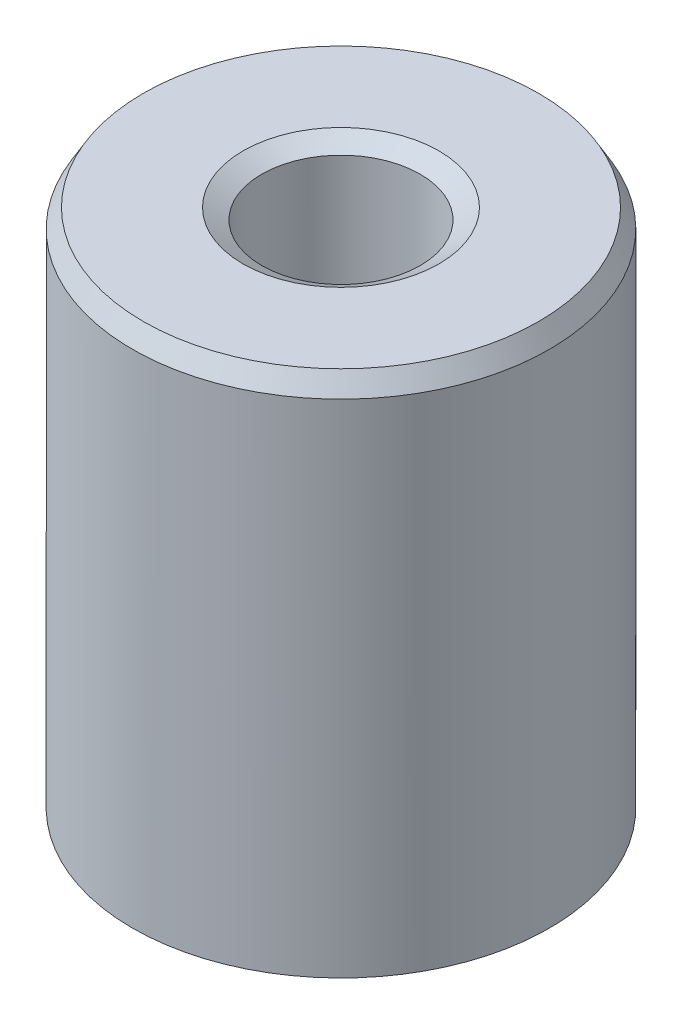
ISO-10303-21;
HEADER;
FILE_DESCRIPTION(('STEP AP214'),'2;1');
FILE_NAME('part.step','',(''),(''),'','','');
FILE_SCHEMA(('AUTOMOTIVE_DESIGN { 1 0 10303 214 1 1 1 1 }'));
ENDSEC;
DATA;
#1=APPLICATION_CONTEXT('core data for automotive mechanical design processes');
#2=APPLICATION_PROTOCOL_DEFINITION('international standard','automotive_design',2000,#1);
#3=PRODUCT_CONTEXT('',#1,'mechanical');
#4=PRODUCT('Part','Part','',(#3));
#5=PRODUCT_RELATED_PRODUCT_CATEGORY('part','',(#4));
#6=PRODUCT_DEFINITION_FORMATION('','',#4);
#7=PRODUCT_DEFINITION_CONTEXT('part definition',#1,'design');
#8=PRODUCT_DEFINITION('design','',#6,#7);
#9=PRODUCT_DEFINITION_SHAPE('','',#8);
#10=(LENGTH_UNIT() NAMED_UNIT(*) SI_UNIT(.MILLI.,.METRE.));
#11=(NAMED_UNIT(*) PLANE_ANGLE_UNIT() SI_UNIT($,.RADIAN.));
#12=(NAMED_UNIT(*) SI_UNIT($,.STERADIAN.) SOLID_ANGLE_UNIT());
#13=UNCERTAINTY_MEASURE_WITH_UNIT(LENGTH_MEASURE(1.E-05),#10,'distance_accuracy_value','');
#14=(GEOMETRIC_REPRESENTATION_CONTEXT(3) GLOBAL_UNCERTAINTY_ASSIGNED_CONTEXT((#13)) GLOBAL_UNIT_ASSIGNED_CONTEXT((#10,
#11,#12)) REPRESENTATION_CONTEXT('',''));
#15=CARTESIAN_POINT('',(0.,0.,0.));
#16=DIRECTION('',(0.,0.,1.));
#17=DIRECTION('',(1.,0.,0.));
#18=AXIS2_PLACEMENT_3D('',#15,#16,#17);
#19=CARTESIAN_POINT('',(0.,38.1916685769268,0.));
#20=DIRECTION('',(0.,-1.,0.));
#21=DIRECTION('',(0.,0.,-1.));
#22=AXIS2_PLACEMENT_3D('',#19,#20,#21);
#23=CYLINDRICAL_SURFACE('',#22,15.);
#24=CARTESIAN_POINT('',(0.,0.777088316908363,0.));
#25=DIRECTION('',(0.,1.,0.));
#26=DIRECTION('',(0.,0.,1.));
#27=AXIS2_PLACEMENT_3D('',#24,#25,#26);
#28=CIRCLE('',#27,15.);
#29=CARTESIAN_POINT('',(0.,0.777088316908356,-15.));
#30=VERTEX_POINT('',#29);
#31=EDGE_CURVE('E10',#30,#30,#28,.T.);
#32=CARTESIAN_POINT('',(0.,36.8457121300734,0.));
#33=DIRECTION('',(0.,1.,0.));
#34=DIRECTION('',(0.,0.,1.));
#35=AXIS2_PLACEMENT_3D('',#32,#33,#34);
#36=CIRCLE('',#35,15.);
#37=CARTESIAN_POINT('',(0.,36.8457121300734,-15.));
#38=VERTEX_POINT('',#37);
#39=EDGE_CURVE('E50',#38,#38,#36,.F.);
#40=CARTESIAN_POINT('',(0.,0.777088316908356,-15.));
#41=CARTESIAN_POINT('',(0.,1.15280314829549,-15.));
#42=CARTESIAN_POINT('',(0.,1.52851797968263,-15.));
#43=CARTESIAN_POINT('',(0.,2.2799476424569,-15.));
#44=CARTESIAN_POINT('',(0.,2.65566247384403,-15.));
#45=CARTESIAN_POINT('',(0.,3.4070921366183,-15.));
#46=CARTESIAN_POINT('',(0.,3.78280696800544,-15.));
#47=CARTESIAN_POINT('',(0.,4.53423663077971,-15.));
#48=CARTESIAN_POINT('',(0.,4.90995146216685,-15.));
#49=CARTESIAN_POINT('',(0.,5.66138112494112,-15.));
#50=CARTESIAN_POINT('',(0.,6.03709595632825,-15.));
#51=CARTESIAN_POINT('',(0.,6.78852561910253,-15.));
#52=CARTESIAN_POINT('',(0.,7.16424045048966,-15.));
#53=CARTESIAN_POINT('',(0.,7.91567011326393,-15.));
#54=CARTESIAN_POINT('',(0.,8.29138494465106,-15.));
#55=CARTESIAN_POINT('',(0.,9.04281460742533,-15.));
#56=CARTESIAN_POINT('',(0.,9.41852943881247,-15.));
#57=CARTESIAN_POINT('',(0.,10.1699591015867,-15.));
#58=CARTESIAN_POINT('',(0.,10.5456739329739,-15.));
#59=CARTESIAN_POINT('',(0.,11.2971035957481,-15.));
#60=CARTESIAN_POINT('',(0.,11.6728184271353,-15.));
#61=CARTESIAN_POINT('',(0.,12.4242480899096,-15.));
#62=CARTESIAN_POINT('',(0.,12.7999629212967,-15.));
#63=CARTESIAN_POINT('',(0.,13.551392584071,-15.));
#64=CARTESIAN_POINT('',(0.,13.9271074154581,-15.));
#65=CARTESIAN_POINT('',(0.,14.6785370782324,-15.));
#66=CARTESIAN_POINT('',(0.,15.0542519096195,-15.));
#67=CARTESIAN_POINT('',(0.,15.8056815723938,-15.));
#68=CARTESIAN_POINT('',(0.,16.1813964037809,-15.));
#69=CARTESIAN_POINT('',(0.,16.9328260665552,-15.));
#70=CARTESIAN_POINT('',(0.,17.3085408979423,-15.));
#71=CARTESIAN_POINT('',(0.,18.0599705607166,-15.));
#72=CARTESIAN_POINT('',(0.,18.4356853921037,-15.));
#73=CARTESIAN_POINT('',(0.,19.187115054878,-15.));
#74=CARTESIAN_POINT('',(0.,19.5628298862651,-15.));
#75=CARTESIAN_POINT('',(0.,20.3142595490394,-15.));
#76=CARTESIAN_POINT('',(0.,20.6899743804265,-15.));
#77=CARTESIAN_POINT('',(0.,21.4414040432008,-15.));
#78=CARTESIAN_POINT('',(0.,21.8171188745879,-15.));
#79=CARTESIAN_POINT('',(0.,22.5685485373622,-15.));
#80=CARTESIAN_POINT('',(0.,22.9442633687493,-15.));
#81=CARTESIAN_POINT('',(0.,23.6956930315236,-15.));
#82=CARTESIAN_POINT('',(0.,24.0714078629108,-15.));
#83=CARTESIAN_POINT('',(0.,24.822837525685,-15.));
#84=CARTESIAN_POINT('',(0.,25.1985523570722,-15.));
#85=CARTESIAN_POINT('',(0.,25.9499820198464,-15.));
#86=CARTESIAN_POINT('',(0.,26.3256968512336,-15.));
#87=CARTESIAN_POINT('',(0.,27.0771265140078,-15.));
#88=CARTESIAN_POINT('',(0.,27.452841345395,-15.));
#89=CARTESIAN_POINT('',(0.,28.2042710081693,-15.));
#90=CARTESIAN_POINT('',(0.,28.5799858395564,-15.));
#91=CARTESIAN_POINT('',(0.,29.3314155023307,-15.));
#92=CARTESIAN_POINT('',(0.,29.7071303337178,-15.));
#93=CARTESIAN_POINT('',(0.,30.4585599964921,-15.));
#94=CARTESIAN_POINT('',(0.,30.8342748278792,-15.));
#95=CARTESIAN_POINT('',(0.,31.5857044906535,-15.));
#96=CARTESIAN_POINT('',(0.,31.9614193220406,-15.));
#97=CARTESIAN_POINT('',(0.,32.7128489848149,-15.));
#98=CARTESIAN_POINT('',(0.,33.088563816202,-15.));
#99=CARTESIAN_POINT('',(0.,33.8399934789763,-15.));
#100=CARTESIAN_POINT('',(0.,34.2157083103634,-15.));
#101=CARTESIAN_POINT('',(0.,34.9671379731377,-15.));
#102=CARTESIAN_POINT('',(0.,35.3428528045248,-15.));
#103=CARTESIAN_POINT('',(0.,36.0942824672991,-15.));
#104=CARTESIAN_POINT('',(0.,36.4699972986862,-15.));
#105=CARTESIAN_POINT('',(0.,36.8457121300734,-15.));
#106=B_SPLINE_CURVE_WITH_KNOTS('',3,(#40,#41,#42,#43,#44,#45,#46,#47,#48,#49,#50,#51,#52,#53,
#54,#55,#56,#57,#58,#59,#60,#61,#62,#63,#64,#65,#66,#67,#68,#69,#70,#71,#72,#73,#74,#75,#76,#77,
#78,#79,#80,#81,#82,#83,#84,#85,#86,#87,#88,#89,#90,#91,#92,#93,#94,#95,#96,#97,#98,#99,#100,
#101,#102,#103,#104,#105),.UNSPECIFIED.,.F.,.F.,(4,2,2,2,2,2,2,2,2,2,2,2,2,2,2,2,2,2,2,2,2,2,2,
2,2,2,2,2,2,2,2,2,4),(0.,1.12714449416141,2.25428898832281,3.38143348248422,4.50857797664563,
5.63572247080703,6.76286696496844,7.89001145912984,9.01715595329125,10.1443004474527,
11.2714449416141,12.3985894357755,13.5257339299369,14.6528784240983,15.7800229182597,
16.9071674124211,18.0343119065825,19.1614564007439,20.2886008949053,21.4157453890667,
22.5428898832281,23.6700343773895,24.7971788715509,25.9243233657123,27.0514678598738,
28.1786123540352,29.3057568481966,30.432901342358,31.5600458365194,32.6871903306808,
33.8143348248422,34.9414793190036,36.068623813165),.UNSPECIFIED.);
#107=EDGE_CURVE('BSEAM39',#30,#38,#106,.T.);
#108=ORIENTED_EDGE('',*,*,#31,.T.);
#109=ORIENTED_EDGE('',*,*,#39,.T.);
#110=ORIENTED_EDGE('',*,*,#107,.T.);
#111=ORIENTED_EDGE('',*,*,#107,.F.);
#112=EDGE_LOOP('',(#108,#110,#109,#111));
#113=FACE_BOUND('',#112,.T.);
#114=ADVANCED_FACE('F39',(#113),#23,.T.);
#115=CARTESIAN_POINT('',(0.,38.1916685769268,0.));
#116=DIRECTION('',(0.,1.,0.));
#117=DIRECTION('',(0.,0.,1.));
#118=AXIS2_PLACEMENT_3D('',#115,#116,#117);
#119=PLANE('',#118);
#120=CARTESIAN_POINT('',(0.,38.1916685769268,0.));
#121=DIRECTION('',(0.,1.,0.));
#122=DIRECTION('',(0.,0.,1.));
#123=AXIS2_PLACEMENT_3D('',#120,#121,#122);
#124=CIRCLE('',#123,7.04701732335984);
#125=CARTESIAN_POINT('',(0.,38.1916685769268,7.04701732335984));
#126=VERTEX_POINT('',#125);
#127=EDGE_CURVE('E58',#126,#126,#124,.F.);
#128=ORIENTED_EDGE('',*,*,#127,.T.);
#129=EDGE_LOOP('',(#128));
#130=FACE_BOUND('',#129,.T.);
#131=CARTESIAN_POINT('',(0.,38.1916685769268,0.));
#132=DIRECTION('',(0.,1.,0.));
#133=DIRECTION('',(0.,0.,1.));
#134=AXIS2_PLACEMENT_3D('',#131,#132,#133);
#135=CIRCLE('',#134,14.2229116830917);
#136=CARTESIAN_POINT('',(0.,38.1916685769268,14.2229116830917));
#137=VERTEX_POINT('',#136);
#138=EDGE_CURVE('E61',#137,#137,#135,.T.);
#139=ORIENTED_EDGE('',*,*,#138,.T.);
#140=EDGE_LOOP('',(#139));
#141=FACE_BOUND('',#140,.T.);
#142=ADVANCED_FACE('F88',(#130,#141),#119,.T.);
#143=CARTESIAN_POINT('',(0.,0.,0.));
#144=DIRECTION('',(0.,1.,0.));
#145=DIRECTION('',(0.,0.,1.));
#146=AXIS2_PLACEMENT_3D('',#143,#144,#145);
#147=PLANE('',#146);
#148=CARTESIAN_POINT('',(0.,0.,0.));
#149=DIRECTION('',(0.,1.,0.));
#150=DIRECTION('',(0.,0.,1.));
#151=AXIS2_PLACEMENT_3D('',#148,#149,#150);
#152=CIRCLE('',#151,6.47814919341472);
#153=CARTESIAN_POINT('',(0.,0.,-6.47814919341472));
#154=VERTEX_POINT('',#153);
#155=EDGE_CURVE('E51',#154,#154,#152,.T.);
#156=ORIENTED_EDGE('',*,*,#155,.T.);
#157=EDGE_LOOP('',(#156));
#158=FACE_BOUND('',#157,.T.);
#159=CARTESIAN_POINT('',(0.,0.,0.));
#160=DIRECTION('',(0.,1.,0.));
#161=DIRECTION('',(0.,0.,1.));
#162=AXIS2_PLACEMENT_3D('',#159,#160,#161);
#163=CIRCLE('',#162,13.6540435531465);
#164=CARTESIAN_POINT('',(0.,0.,13.6540435531465));
#165=VERTEX_POINT('',#164);
#166=EDGE_CURVE('E54',#165,#165,#163,.F.);
#167=ORIENTED_EDGE('',*,*,#166,.T.);
#168=EDGE_LOOP('',(#167));
#169=FACE_BOUND('',#168,.T.);
#170=ADVANCED_FACE('F83',(#158,#169),#147,.F.);
#171=CARTESIAN_POINT('',(0.,38.1916685769268,0.));
#172=DIRECTION('',(0.,-1.,0.));
#173=DIRECTION('',(0.,0.,-1.));
#174=AXIS2_PLACEMENT_3D('',#171,#172,#173);
#175=CYLINDRICAL_SURFACE('',#174,5.70106087650638);
#176=CARTESIAN_POINT('',(0.,37.4145802600184,0.));
#177=DIRECTION('',(0.,1.,0.));
#178=DIRECTION('',(0.,0.,1.));
#179=AXIS2_PLACEMENT_3D('',#176,#177,#178);
#180=CIRCLE('',#179,5.70106087650638);
#181=CARTESIAN_POINT('',(0.,37.4145802600184,-5.70106087650638));
#182=VERTEX_POINT('',#181);
#183=EDGE_CURVE('E67',#182,#182,#180,.T.);
#184=CARTESIAN_POINT('',(0.,1.34595644685344,0.));
#185=DIRECTION('',(0.,1.,0.));
#186=DIRECTION('',(0.,0.,1.));
#187=AXIS2_PLACEMENT_3D('',#184,#185,#186);
#188=CIRCLE('',#187,5.70106087650638);
#189=CARTESIAN_POINT('',(0.,1.34595644685344,-5.70106087650638));
#190=VERTEX_POINT('',#189);
#191=EDGE_CURVE('E69',#190,#190,#188,.F.);
#192=CARTESIAN_POINT('',(0.,37.4145802600184,-5.70106087650638));
#193=CARTESIAN_POINT('',(0.,37.0388654286313,-5.70106087650638));
#194=CARTESIAN_POINT('',(0.,36.6631505972441,-5.70106087650638));
#195=CARTESIAN_POINT('',(0.,35.9117209344699,-5.70106087650638));
#196=CARTESIAN_POINT('',(0.,35.5360061030827,-5.70106087650638));
#197=CARTESIAN_POINT('',(0.,34.7845764403085,-5.70106087650638));
#198=CARTESIAN_POINT('',(0.,34.4088616089213,-5.70106087650638));
#199=CARTESIAN_POINT('',(0.,33.6574319461471,-5.70106087650638));
#200=CARTESIAN_POINT('',(0.,33.2817171147599,-5.70106087650638));
#201=CARTESIAN_POINT('',(0.,32.5302874519857,-5.70106087650638));
#202=CARTESIAN_POINT('',(0.,32.1545726205985,-5.70106087650638));
#203=CARTESIAN_POINT('',(0.,31.4031429578242,-5.70106087650638));
#204=CARTESIAN_POINT('',(0.,31.0274281264371,-5.70106087650638));
#205=CARTESIAN_POINT('',(0.,30.2759984636628,-5.70106087650638));
#206=CARTESIAN_POINT('',(0.,29.9002836322757,-5.70106087650638));
#207=CARTESIAN_POINT('',(0.,29.1488539695014,-5.70106087650638));
#208=CARTESIAN_POINT('',(0.,28.7731391381143,-5.70106087650638));
#209=CARTESIAN_POINT('',(0.,28.02170947534,-5.70106087650638));
#210=CARTESIAN_POINT('',(0.,27.6459946439529,-5.70106087650638));
#211=CARTESIAN_POINT('',(0.,26.8945649811786,-5.70106087650638));
#212=CARTESIAN_POINT('',(0.,26.5188501497915,-5.70106087650638));
#213=CARTESIAN_POINT('',(0.,25.7674204870172,-5.70106087650638));
#214=CARTESIAN_POINT('',(0.,25.3917056556301,-5.70106087650638));
#215=CARTESIAN_POINT('',(0.,24.6402759928558,-5.70106087650638));
#216=CARTESIAN_POINT('',(0.,24.2645611614687,-5.70106087650638));
#217=CARTESIAN_POINT('',(0.,23.5131314986944,-5.70106087650638));
#218=CARTESIAN_POINT('',(0.,23.1374166673073,-5.70106087650638));
#219=CARTESIAN_POINT('',(0.,22.385987004533,-5.70106087650638));
#220=CARTESIAN_POINT('',(0.,22.0102721731459,-5.70106087650638));
#221=CARTESIAN_POINT('',(0.,21.2588425103716,-5.70106087650638));
#222=CARTESIAN_POINT('',(0.,20.8831276789845,-5.70106087650638));
#223=CARTESIAN_POINT('',(0.,20.1316980162102,-5.70106087650638));
#224=CARTESIAN_POINT('',(0.,19.7559831848231,-5.70106087650638));
#225=CARTESIAN_POINT('',(0.,19.0045535220488,-5.70106087650638));
#226=CARTESIAN_POINT('',(0.,18.6288386906617,-5.70106087650638));
#227=CARTESIAN_POINT('',(0.,17.8774090278874,-5.70106087650638));
#228=CARTESIAN_POINT('',(0.,17.5016941965002,-5.70106087650638));
#229=CARTESIAN_POINT('',(0.,16.750264533726,-5.70106087650638));
#230=CARTESIAN_POINT('',(0.,16.3745497023388,-5.70106087650638));
#231=CARTESIAN_POINT('',(0.,15.6231200395646,-5.70106087650638));
#232=CARTESIAN_POINT('',(0.,15.2474052081774,-5.70106087650638));
#233=CARTESIAN_POINT('',(0.,14.4959755454032,-5.70106087650638));
#234=CARTESIAN_POINT('',(0.,14.120260714016,-5.70106087650638));
#235=CARTESIAN_POINT('',(0.,13.3688310512418,-5.70106087650638));
#236=CARTESIAN_POINT('',(0.,12.9931162198546,-5.70106087650638));
#237=CARTESIAN_POINT('',(0.,12.2416865570804,-5.70106087650638));
#238=CARTESIAN_POINT('',(0.,11.8659717256932,-5.70106087650638));
#239=CARTESIAN_POINT('',(0.,11.114542062919,-5.70106087650638));
#240=CARTESIAN_POINT('',(0.,10.7388272315318,-5.70106087650638));
#241=CARTESIAN_POINT('',(0.,9.98739756875755,-5.70106087650638));
#242=CARTESIAN_POINT('',(0.,9.61168273737041,-5.70106087650638));
#243=CARTESIAN_POINT('',(0.,8.86025307459614,-5.70106087650638));
#244=CARTESIAN_POINT('',(0.,8.48453824320901,-5.70106087650638));
#245=CARTESIAN_POINT('',(0.,7.73310858043473,-5.70106087650638));
#246=CARTESIAN_POINT('',(0.,7.3573937490476,-5.70106087650638));
#247=CARTESIAN_POINT('',(0.,6.60596408627333,-5.70106087650638));
#248=CARTESIAN_POINT('',(0.,6.2302492548862,-5.70106087650638));
#249=CARTESIAN_POINT('',(0.,5.47881959211193,-5.70106087650638));
#250=CARTESIAN_POINT('',(0.,5.10310476072479,-5.70106087650638));
#251=CARTESIAN_POINT('',(0.,4.35167509795052,-5.70106087650638));
#252=CARTESIAN_POINT('',(0.,3.97596026656339,-5.70106087650638));
#253=CARTESIAN_POINT('',(0.,3.22453060378911,-5.70106087650638));
#254=CARTESIAN_POINT('',(0.,2.84881577240198,-5.70106087650638));
#255=CARTESIAN_POINT('',(0.,2.09738610962771,-5.70106087650638));
#256=CARTESIAN_POINT('',(0.,1.72167127824057,-5.70106087650638));
#257=CARTESIAN_POINT('',(0.,1.34595644685344,-5.70106087650638));
#258=B_SPLINE_CURVE_WITH_KNOTS('',3,(#192,#193,#194,#195,#196,#197,#198,#199,#200,#201,#202,
#203,#204,#205,#206,#207,#208,#209,#210,#211,#212,#213,#214,#215,#216,#217,#218,#219,#220,#221,
#222,#223,#224,#225,#226,#227,#228,#229,#230,#231,#232,#233,#234,#235,#236,#237,#238,#239,#240,
#241,#242,#243,#244,#245,#246,#247,#248,#249,#250,#251,#252,#253,#254,#255,#256,#257),
.UNSPECIFIED.,.F.,.F.,(4,2,2,2,2,2,2,2,2,2,2,2,2,2,2,2,2,2,2,2,2,2,2,2,2,2,2,2,2,2,2,2,4),(0.,
1.1271444941614,2.25428898832281,3.38143348248422,4.50857797664562,5.63572247080702,
6.76286696496843,7.89001145912983,9.01715595329124,10.1443004474526,11.271444941614,
12.3985894357755,13.5257339299369,14.6528784240983,15.7800229182597,16.9071674124211,
18.0343119065825,19.1614564007439,20.2886008949053,21.4157453890667,22.5428898832281,
23.6700343773895,24.7971788715509,25.9243233657123,27.0514678598737,28.1786123540351,
29.3057568481965,30.4329013423579,31.5600458365193,32.6871903306807,33.8143348248422,
34.9414793190036,36.068623813165),.UNSPECIFIED.);
#259=EDGE_CURVE('BSEAM71',#182,#190,#258,.T.);
#260=ORIENTED_EDGE('',*,*,#183,.T.);
#261=ORIENTED_EDGE('',*,*,#191,.T.);
#262=ORIENTED_EDGE('',*,*,#259,.T.);
#263=ORIENTED_EDGE('',*,*,#259,.F.);
#264=EDGE_LOOP('',(#260,#262,#261,#263));
#265=FACE_BOUND('',#264,.T.);
#266=ADVANCED_FACE('F71',(#265),#175,.F.);
#267=CARTESIAN_POINT('',(0.,37.4145802600184,0.));
#268=DIRECTION('',(0.,1.,0.));
#269=DIRECTION('',(0.,0.,1.));
#270=AXIS2_PLACEMENT_3D('',#267,#268,#269);
#271=CONICAL_SURFACE('',#270,5.70106087650638,1.0471975511966);
#272=ORIENTED_EDGE('',*,*,#127,.F.);
#273=EDGE_LOOP('',(#272));
#274=FACE_BOUND('',#273,.T.);
#275=ORIENTED_EDGE('',*,*,#183,.F.);
#276=EDGE_LOOP('',(#275));
#277=FACE_BOUND('',#276,.T.);
#278=ADVANCED_FACE('F77',(#274,#277),#271,.F.);
#279=CARTESIAN_POINT('',(0.,0.,0.));
#280=DIRECTION('',(0.,-1.,0.));
#281=DIRECTION('',(0.,0.,-1.));
#282=AXIS2_PLACEMENT_3D('',#279,#280,#281);
#283=CONICAL_SURFACE('',#282,6.47814919341472,0.523598775598296);
#284=CARTESIAN_POINT('',(0.,1.34595644685344,-5.70106087650638));
#285=CARTESIAN_POINT('',(0.,1.33193606719872,-5.70915554647417));
#286=CARTESIAN_POINT('',(0.,1.31791568754399,-5.71725021644197));
#287=CARTESIAN_POINT('',(0.,1.28987492823455,-5.73343955637756));
#288=CARTESIAN_POINT('',(0.,1.27585454857982,-5.74153422634535));
#289=CARTESIAN_POINT('',(0.,1.24781378927038,-5.75772356628094));
#290=CARTESIAN_POINT('',(0.,1.23379340961565,-5.76581823624874));
#291=CARTESIAN_POINT('',(0.,1.20575265030621,-5.78200757618433));
#292=CARTESIAN_POINT('',(0.,1.19173227065148,-5.79010224615212));
#293=CARTESIAN_POINT('',(0.,1.16369151134204,-5.80629158608771));
#294=CARTESIAN_POINT('',(0.,1.14967113168731,-5.81438625605551));
#295=CARTESIAN_POINT('',(0.,1.12163037237787,-5.8305755959911));
#296=CARTESIAN_POINT('',(0.,1.10760999272314,-5.8386702659589));
#297=CARTESIAN_POINT('',(0.,1.0795692334137,-5.85485960589449));
#298=CARTESIAN_POINT('',(0.,1.06554885375897,-5.86295427586228));
#299=CARTESIAN_POINT('',(0.,1.03750809444953,-5.87914361579787));
#300=CARTESIAN_POINT('',(0.,1.0234877147948,-5.88723828576567));
#301=CARTESIAN_POINT('',(0.,0.995446955485355,-5.90342762570126));
#302=CARTESIAN_POINT('',(0.,0.981426575830632,-5.91152229566905));
#303=CARTESIAN_POINT('',(0.,0.953385816521185,-5.92771163560464));
#304=CARTESIAN_POINT('',(0.,0.939365436866462,-5.93580630557244));
#305=CARTESIAN_POINT('',(0.,0.911324677557016,-5.95199564550803));
#306=CARTESIAN_POINT('',(0.,0.897304297902292,-5.96009031547582));
#307=CARTESIAN_POINT('',(0.,0.869263538592846,-5.97627965541141));
#308=CARTESIAN_POINT('',(0.,0.855243158938122,-5.98437432537921));
#309=CARTESIAN_POINT('',(0.,0.827202399628676,-6.0005636653148));
#310=CARTESIAN_POINT('',(0.,0.813182019973952,-6.00865833528259));
#311=CARTESIAN_POINT('',(0.,0.785141260664506,-6.02484767521818));
#312=CARTESIAN_POINT('',(0.,0.771120881009782,-6.03294234518598));
#313=CARTESIAN_POINT('',(0.,0.743080121700336,-6.04913168512157));
#314=CARTESIAN_POINT('',(0.,0.729059742045612,-6.05722635508937));
#315=CARTESIAN_POINT('',(0.,0.701018982736166,-6.07341569502496));
#316=CARTESIAN_POINT('',(0.,0.686998603081442,-6.08151036499275));
#317=CARTESIAN_POINT('',(0.,0.658957843771996,-6.09769970492834));
#318=CARTESIAN_POINT('',(0.,0.644937464117273,-6.10579437489614));
#319=CARTESIAN_POINT('',(0.,0.616896704807826,-6.12198371483173));
#320=CARTESIAN_POINT('',(0.,0.602876325153103,-6.13007838479952));
#321=CARTESIAN_POINT('',(0.,0.574835565843656,-6.14626772473511));
#322=CARTESIAN_POINT('',(0.,0.560815186188933,-6.15436239470291));
#323=CARTESIAN_POINT('',(0.,0.532774426879486,-6.1705517346385));
#324=CARTESIAN_POINT('',(0.,0.518754047224763,-6.17864640460629));
#325=CARTESIAN_POINT('',(0.,0.490713287915316,-6.19483574454188));
#326=CARTESIAN_POINT('',(0.,0.476692908260593,-6.20293041450968));
#327=CARTESIAN_POINT('',(0.,0.448652148951146,-6.21911975444527));
#328=CARTESIAN_POINT('',(0.,0.434631769296423,-6.22721442441307));
#329=CARTESIAN_POINT('',(0.,0.406591009986976,-6.24340376434866));
#330=CARTESIAN_POINT('',(0.,0.392570630332253,-6.25149843431645));
#331=CARTESIAN_POINT('',(0.,0.364529871022806,-6.26768777425204));
#332=CARTESIAN_POINT('',(0.,0.350509491368083,-6.27578244421984));
#333=CARTESIAN_POINT('',(0.,0.322468732058636,-6.29197178415543));
#334=CARTESIAN_POINT('',(0.,0.308448352403913,-6.30006645412322));
#335=CARTESIAN_POINT('',(0.,0.280407593094466,-6.31625579405881));
#336=CARTESIAN_POINT('',(0.,0.266387213439743,-6.32435046402661));
#337=CARTESIAN_POINT('',(0.,0.238346454130296,-6.3405398039622));
#338=CARTESIAN_POINT('',(0.,0.224326074475573,-6.34863447392999));
#339=CARTESIAN_POINT('',(0.,0.196285315166126,-6.36482381386558));
#340=CARTESIAN_POINT('',(0.,0.182264935511403,-6.37291848383338));
#341=CARTESIAN_POINT('',(0.,0.154224176201956,-6.38910782376897));
#342=CARTESIAN_POINT('',(0.,0.140203796547233,-6.39720249373676));
#343=CARTESIAN_POINT('',(0.,0.112163037237787,-6.41339183367235));
#344=CARTESIAN_POINT('',(0.,0.0981426575830632,-6.42148650364015));
#345=CARTESIAN_POINT('',(0.,0.0701018982736166,-6.43767584357574));
#346=CARTESIAN_POINT('',(0.,0.0560815186188933,-6.44577051354354));
#347=CARTESIAN_POINT('',(0.,0.0280407593094466,-6.46195985347913));
#348=CARTESIAN_POINT('',(0.,0.0140203796547233,-6.47005452344692));
#349=CARTESIAN_POINT('',(0.,0.,-6.47814919341472));
#350=B_SPLINE_CURVE_WITH_KNOTS('',3,(#284,#285,#286,#287,#288,#289,#290,#291,#292,#293,#294,
#295,#296,#297,#298,#299,#300,#301,#302,#303,#304,#305,#306,#307,#308,#309,#310,#311,#312,#313,
#314,#315,#316,#317,#318,#319,#320,#321,#322,#323,#324,#325,#326,#327,#328,#329,#330,#331,#332,
#333,#334,#335,#336,#337,#338,#339,#340,#341,#342,#343,#344,#345,#346,#347,#348,#349),
.UNSPECIFIED.,.F.,.F.,(4,2,2,2,2,2,2,2,2,2,2,2,2,2,2,2,2,2,2,2,2,2,2,2,2,2,2,2,2,2,2,2,4),(0.,
0.0485680198067715,0.097136039613543,0.145704059420315,0.194272079227086,0.242840099033858,
0.291408118840629,0.339976138647401,0.388544158454172,0.437112178260944,0.485680198067715,
0.534248217874487,0.582816237681258,0.631384257488029,0.679952277294801,0.728520297101572,
0.777088316908344,0.825656336715115,0.874224356521886,0.922792376328658,0.971360396135429,
1.0199284159422,1.06849643574897,1.11706445555574,1.16563247536252,1.21420049516929,
1.26276851497606,1.31133653478283,1.3599045545896,1.40847257439637,1.45704059420314,
1.50560861400992,1.55417663381669),.UNSPECIFIED.);
#351=EDGE_CURVE('BSEAM73',#190,#154,#350,.T.);
#352=ORIENTED_EDGE('',*,*,#191,.F.);
#353=ORIENTED_EDGE('',*,*,#155,.F.);
#354=ORIENTED_EDGE('',*,*,#351,.T.);
#355=ORIENTED_EDGE('',*,*,#351,.F.);
#356=EDGE_LOOP('',(#352,#354,#353,#355));
#357=FACE_BOUND('',#356,.T.);
#358=ADVANCED_FACE('F73',(#357),#283,.F.);
#359=CARTESIAN_POINT('',(0.,0.777088316908363,0.));
#360=DIRECTION('',(0.,1.,0.));
#361=DIRECTION('',(0.,0.,1.));
#362=AXIS2_PLACEMENT_3D('',#359,#360,#361);
#363=CONICAL_SURFACE('',#362,15.,1.0471975511966);
#364=ORIENTED_EDGE('',*,*,#166,.F.);
#365=EDGE_LOOP('',(#364));
#366=FACE_BOUND('',#365,.T.);
#367=ORIENTED_EDGE('',*,*,#31,.F.);
#368=EDGE_LOOP('',(#367));
#369=FACE_BOUND('',#368,.T.);
#370=ADVANCED_FACE('F76',(#366,#369),#363,.T.);
#371=CARTESIAN_POINT('',(0.,38.1916685769268,0.));
#372=DIRECTION('',(0.,-1.,0.));
#373=DIRECTION('',(0.,0.,-1.));
#374=AXIS2_PLACEMENT_3D('',#371,#372,#373);
#375=CONICAL_SURFACE('',#374,14.2229116830917,0.523598775598291);
#376=ORIENTED_EDGE('',*,*,#39,.F.);
#377=EDGE_LOOP('',(#376));
#378=FACE_BOUND('',#377,.T.);
#379=ORIENTED_EDGE('',*,*,#138,.F.);
#380=EDGE_LOOP('',(#379));
#381=FACE_BOUND('',#380,.T.);
#382=ADVANCED_FACE('F45',(#378,#381),#375,.T.);
#383=CLOSED_SHELL('',(#114,#142,#170,#266,#278,#358,#370,#382));
#384=MANIFOLD_SOLID_BREP('B2',#383);
#385=ADVANCED_BREP_SHAPE_REPRESENTATION('',(#18,#384),#14);
#386=SHAPE_DEFINITION_REPRESENTATION(#9,#385);
ENDSEC;
END-ISO-10303-21;
